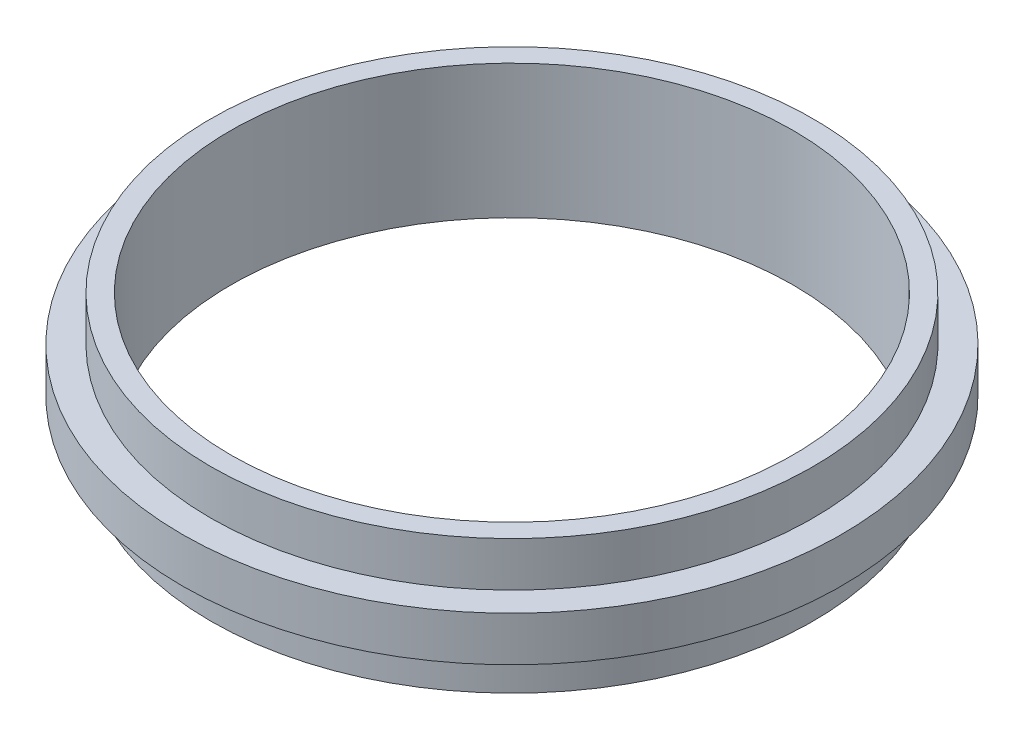
ISO-10303-21;
HEADER;
FILE_DESCRIPTION(('STEP AP214'),'2;1');
FILE_NAME('part.step','',(''),(''),'','','');
FILE_SCHEMA(('AUTOMOTIVE_DESIGN { 1 0 10303 214 1 1 1 1 }'));
ENDSEC;
DATA;
#1=APPLICATION_CONTEXT('core data for automotive mechanical design processes');
#2=APPLICATION_PROTOCOL_DEFINITION('international standard','automotive_design',2000,#1);
#3=PRODUCT_CONTEXT('',#1,'mechanical');
#4=PRODUCT('Part','Part','',(#3));
#5=PRODUCT_RELATED_PRODUCT_CATEGORY('part','',(#4));
#6=PRODUCT_DEFINITION_FORMATION('','',#4);
#7=PRODUCT_DEFINITION_CONTEXT('part definition',#1,'design');
#8=PRODUCT_DEFINITION('design','',#6,#7);
#9=PRODUCT_DEFINITION_SHAPE('','',#8);
#10=(LENGTH_UNIT() NAMED_UNIT(*) SI_UNIT(.MILLI.,.METRE.));
#11=(NAMED_UNIT(*) PLANE_ANGLE_UNIT() SI_UNIT($,.RADIAN.));
#12=(NAMED_UNIT(*) SI_UNIT($,.STERADIAN.) SOLID_ANGLE_UNIT());
#13=UNCERTAINTY_MEASURE_WITH_UNIT(LENGTH_MEASURE(1.E-05),#10,'distance_accuracy_value','');
#14=(GEOMETRIC_REPRESENTATION_CONTEXT(3) GLOBAL_UNCERTAINTY_ASSIGNED_CONTEXT((#13)) GLOBAL_UNIT_ASSIGNED_CONTEXT((#10,
#11,#12)) REPRESENTATION_CONTEXT('',''));
#15=CARTESIAN_POINT('',(0.,0.,0.));
#16=DIRECTION('',(0.,0.,1.));
#17=DIRECTION('',(1.,0.,0.));
#18=AXIS2_PLACEMENT_3D('',#15,#16,#17);
#19=CARTESIAN_POINT('',(0.,6.35,0.));
#20=DIRECTION('',(0.,1.,0.));
#21=DIRECTION('',(0.,0.,1.));
#22=AXIS2_PLACEMENT_3D('',#19,#20,#21);
#23=PLANE('',#22);
#24=CARTESIAN_POINT('',(0.,6.35,0.));
#25=DIRECTION('',(0.,1.,0.));
#26=DIRECTION('',(0.,0.,1.));
#27=AXIS2_PLACEMENT_3D('',#24,#25,#26);
#28=CIRCLE('',#27,93.7895);
#29=CARTESIAN_POINT('',(0.,6.35,93.7895));
#30=VERTEX_POINT('',#29);
#31=EDGE_CURVE('E10',#30,#30,#28,.T.);
#32=ORIENTED_EDGE('',*,*,#31,.T.);
#33=EDGE_LOOP('',(#32));
#34=FACE_BOUND('',#33,.T.);
#35=CARTESIAN_POINT('',(0.,6.35,0.));
#36=DIRECTION('',(0.,1.,0.));
#37=DIRECTION('',(0.,0.,1.));
#38=AXIS2_PLACEMENT_3D('',#35,#36,#37);
#39=CIRCLE('',#38,85.725);
#40=CARTESIAN_POINT('',(0.,6.35,85.725));
#41=VERTEX_POINT('',#40);
#42=EDGE_CURVE('E52',#41,#41,#39,.T.);
#43=ORIENTED_EDGE('',*,*,#42,.F.);
#44=EDGE_LOOP('',(#43));
#45=FACE_BOUND('',#44,.T.);
#46=ADVANCED_FACE('F37',(#34,#45),#23,.T.);
#47=CARTESIAN_POINT('',(0.,-6.35,0.));
#48=DIRECTION('',(0.,1.,0.));
#49=DIRECTION('',(0.,0.,1.));
#50=AXIS2_PLACEMENT_3D('',#47,#48,#49);
#51=PLANE('',#50);
#52=CARTESIAN_POINT('',(0.,-6.35,0.));
#53=DIRECTION('',(0.,1.,0.));
#54=DIRECTION('',(0.,0.,1.));
#55=AXIS2_PLACEMENT_3D('',#52,#53,#54);
#56=CIRCLE('',#55,85.725);
#57=CARTESIAN_POINT('',(0.,-6.35,85.725));
#58=VERTEX_POINT('',#57);
#59=EDGE_CURVE('E64',#58,#58,#56,.T.);
#60=ORIENTED_EDGE('',*,*,#59,.T.);
#61=EDGE_LOOP('',(#60));
#62=FACE_BOUND('',#61,.T.);
#63=CARTESIAN_POINT('',(0.,-6.35,0.));
#64=DIRECTION('',(0.,1.,0.));
#65=DIRECTION('',(0.,0.,1.));
#66=AXIS2_PLACEMENT_3D('',#63,#64,#65);
#67=CIRCLE('',#66,93.7895);
#68=CARTESIAN_POINT('',(0.,-6.35,93.7895));
#69=VERTEX_POINT('',#68);
#70=EDGE_CURVE('E41',#69,#69,#67,.T.);
#71=ORIENTED_EDGE('',*,*,#70,.F.);
#72=EDGE_LOOP('',(#71));
#73=FACE_BOUND('',#72,.T.);
#74=ADVANCED_FACE('F91',(#62,#73),#51,.F.);
#75=CARTESIAN_POINT('',(0.,6.35,0.));
#76=DIRECTION('',(0.,-1.,0.));
#77=DIRECTION('',(0.,0.,-1.));
#78=AXIS2_PLACEMENT_3D('',#75,#76,#77);
#79=CYLINDRICAL_SURFACE('',#78,93.7895);
#80=ORIENTED_EDGE('',*,*,#31,.F.);
#81=EDGE_LOOP('',(#80));
#82=FACE_BOUND('',#81,.T.);
#83=ORIENTED_EDGE('',*,*,#70,.T.);
#84=EDGE_LOOP('',(#83));
#85=FACE_BOUND('',#84,.T.);
#86=ADVANCED_FACE('F39',(#82,#85),#79,.T.);
#87=CARTESIAN_POINT('',(0.,6.35,0.));
#88=DIRECTION('',(0.,-1.,0.));
#89=DIRECTION('',(0.,0.,-1.));
#90=AXIS2_PLACEMENT_3D('',#87,#88,#89);
#91=CYLINDRICAL_SURFACE('',#90,80.01);
#92=CARTESIAN_POINT('',(0.,19.05,0.));
#93=DIRECTION('',(0.,1.,0.));
#94=DIRECTION('',(0.,0.,1.));
#95=AXIS2_PLACEMENT_3D('',#92,#93,#94);
#96=CIRCLE('',#95,80.01);
#97=CARTESIAN_POINT('',(0.,19.05,80.01));
#98=VERTEX_POINT('',#97);
#99=EDGE_CURVE('E56',#98,#98,#96,.T.);
#100=ORIENTED_EDGE('',*,*,#99,.T.);
#101=EDGE_LOOP('',(#100));
#102=FACE_BOUND('',#101,.T.);
#103=CARTESIAN_POINT('',(0.,-19.05,0.));
#104=DIRECTION('',(0.,1.,0.));
#105=DIRECTION('',(0.,0.,1.));
#106=AXIS2_PLACEMENT_3D('',#103,#104,#105);
#107=CIRCLE('',#106,80.01);
#108=CARTESIAN_POINT('',(0.,-19.05,80.01));
#109=VERTEX_POINT('',#108);
#110=EDGE_CURVE('E68',#109,#109,#107,.T.);
#111=ORIENTED_EDGE('',*,*,#110,.F.);
#112=EDGE_LOOP('',(#111));
#113=FACE_BOUND('',#112,.T.);
#114=ADVANCED_FACE('F79',(#102,#113),#91,.F.);
#115=CARTESIAN_POINT('',(0.,19.05,0.));
#116=DIRECTION('',(0.,1.,0.));
#117=DIRECTION('',(0.,0.,1.));
#118=AXIS2_PLACEMENT_3D('',#115,#116,#117);
#119=PLANE('',#118);
#120=CARTESIAN_POINT('',(0.,19.05,0.));
#121=DIRECTION('',(0.,1.,0.));
#122=DIRECTION('',(0.,0.,1.));
#123=AXIS2_PLACEMENT_3D('',#120,#121,#122);
#124=CIRCLE('',#123,85.725);
#125=CARTESIAN_POINT('',(0.,19.05,85.725));
#126=VERTEX_POINT('',#125);
#127=EDGE_CURVE('E50',#126,#126,#124,.T.);
#128=ORIENTED_EDGE('',*,*,#127,.T.);
#129=EDGE_LOOP('',(#128));
#130=FACE_BOUND('',#129,.T.);
#131=ORIENTED_EDGE('',*,*,#99,.F.);
#132=EDGE_LOOP('',(#131));
#133=FACE_BOUND('',#132,.T.);
#134=ADVANCED_FACE('F81',(#130,#133),#119,.T.);
#135=CARTESIAN_POINT('',(0.,19.05,0.));
#136=DIRECTION('',(0.,-1.,0.));
#137=DIRECTION('',(0.,0.,-1.));
#138=AXIS2_PLACEMENT_3D('',#135,#136,#137);
#139=CYLINDRICAL_SURFACE('',#138,85.725);
#140=ORIENTED_EDGE('',*,*,#127,.F.);
#141=EDGE_LOOP('',(#140));
#142=FACE_BOUND('',#141,.T.);
#143=ORIENTED_EDGE('',*,*,#42,.T.);
#144=EDGE_LOOP('',(#143));
#145=FACE_BOUND('',#144,.T.);
#146=ADVANCED_FACE('F88',(#142,#145),#139,.T.);
#147=CARTESIAN_POINT('',(0.,-19.05,0.));
#148=DIRECTION('',(0.,1.,0.));
#149=DIRECTION('',(0.,0.,1.));
#150=AXIS2_PLACEMENT_3D('',#147,#148,#149);
#151=CYLINDRICAL_SURFACE('',#150,85.725);
#152=CARTESIAN_POINT('',(0.,-19.05,0.));
#153=DIRECTION('',(0.,1.,0.));
#154=DIRECTION('',(0.,0.,1.));
#155=AXIS2_PLACEMENT_3D('',#152,#153,#154);
#156=CIRCLE('',#155,85.725);
#157=CARTESIAN_POINT('',(0.,-19.05,85.725));
#158=VERTEX_POINT('',#157);
#159=EDGE_CURVE('E63',#158,#158,#156,.T.);
#160=ORIENTED_EDGE('',*,*,#159,.T.);
#161=EDGE_LOOP('',(#160));
#162=FACE_BOUND('',#161,.T.);
#163=ORIENTED_EDGE('',*,*,#59,.F.);
#164=EDGE_LOOP('',(#163));
#165=FACE_BOUND('',#164,.T.);
#166=ADVANCED_FACE('F104',(#162,#165),#151,.T.);
#167=CARTESIAN_POINT('',(0.,-19.05,0.));
#168=DIRECTION('',(0.,-1.,0.));
#169=DIRECTION('',(0.,0.,1.));
#170=AXIS2_PLACEMENT_3D('',#167,#168,#169);
#171=PLANE('',#170);
#172=ORIENTED_EDGE('',*,*,#110,.T.);
#173=EDGE_LOOP('',(#172));
#174=FACE_BOUND('',#173,.T.);
#175=ORIENTED_EDGE('',*,*,#159,.F.);
#176=EDGE_LOOP('',(#175));
#177=FACE_BOUND('',#176,.T.);
#178=ADVANCED_FACE('F76',(#174,#177),#171,.T.);
#179=CLOSED_SHELL('',(#46,#74,#86,#114,#134,#146,#166,#178));
#180=MANIFOLD_SOLID_BREP('B2',#179);
#181=ADVANCED_BREP_SHAPE_REPRESENTATION('',(#18,#180),#14);
#182=SHAPE_DEFINITION_REPRESENTATION(#9,#181);
ENDSEC;
END-ISO-10303-21;
